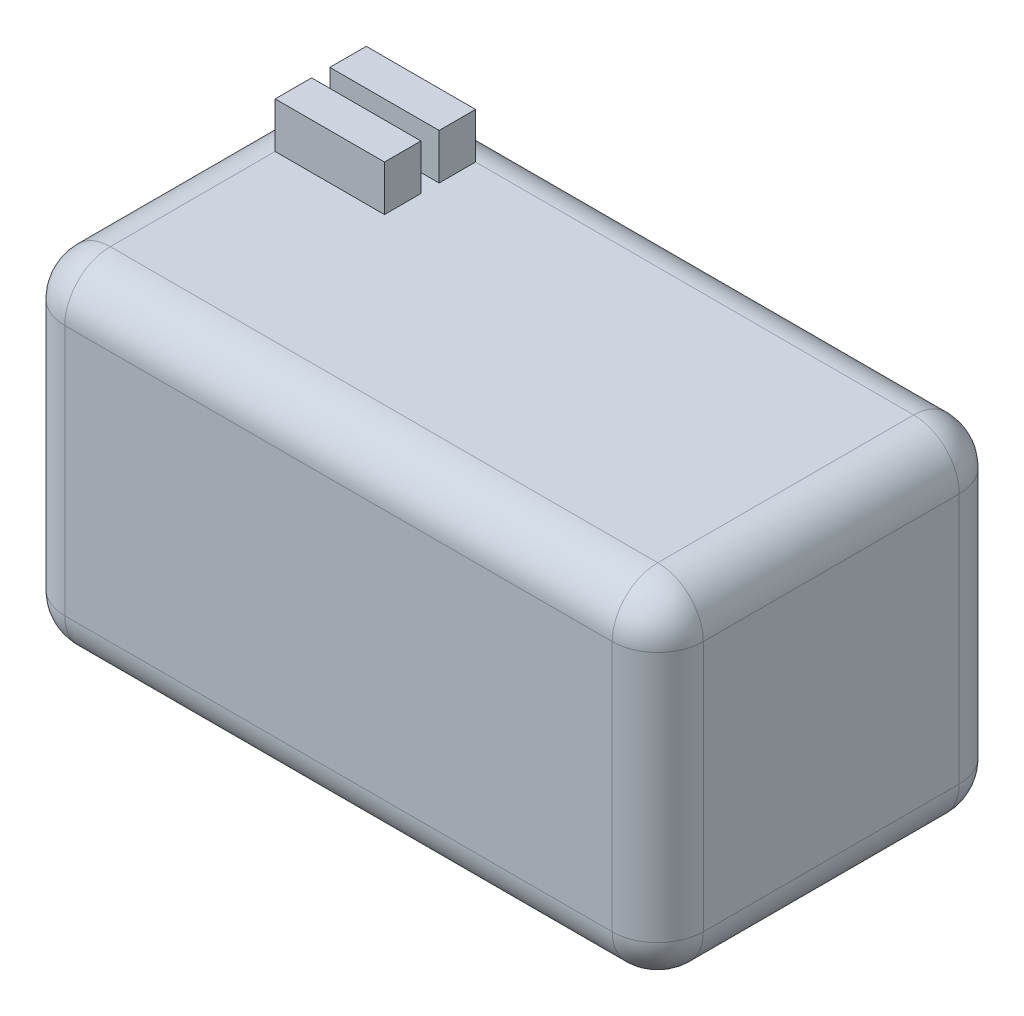
ISO-10303-21;
HEADER;
FILE_DESCRIPTION(('STEP AP214'),'2;1');
FILE_NAME('part.step','',(''),(''),'','','');
FILE_SCHEMA(('AUTOMOTIVE_DESIGN { 1 0 10303 214 1 1 1 1 }'));
ENDSEC;
DATA;
#1=APPLICATION_CONTEXT('core data for automotive mechanical design processes');
#2=APPLICATION_PROTOCOL_DEFINITION('international standard','automotive_design',2000,#1);
#3=PRODUCT_CONTEXT('',#1,'mechanical');
#4=PRODUCT('Part','Part','',(#3));
#5=PRODUCT_RELATED_PRODUCT_CATEGORY('part','',(#4));
#6=PRODUCT_DEFINITION_FORMATION('','',#4);
#7=PRODUCT_DEFINITION_CONTEXT('part definition',#1,'design');
#8=PRODUCT_DEFINITION('design','',#6,#7);
#9=PRODUCT_DEFINITION_SHAPE('','',#8);
#10=(LENGTH_UNIT() NAMED_UNIT(*) SI_UNIT(.MILLI.,.METRE.));
#11=(NAMED_UNIT(*) PLANE_ANGLE_UNIT() SI_UNIT($,.RADIAN.));
#12=(NAMED_UNIT(*) SI_UNIT($,.STERADIAN.) SOLID_ANGLE_UNIT());
#13=UNCERTAINTY_MEASURE_WITH_UNIT(LENGTH_MEASURE(1.E-05),#10,'distance_accuracy_value','');
#14=(GEOMETRIC_REPRESENTATION_CONTEXT(3) GLOBAL_UNCERTAINTY_ASSIGNED_CONTEXT((#13)) GLOBAL_UNIT_ASSIGNED_CONTEXT((#10,
#11,#12)) REPRESENTATION_CONTEXT('',''));
#15=CARTESIAN_POINT('',(0.,0.,0.));
#16=DIRECTION('',(0.,0.,1.));
#17=DIRECTION('',(1.,0.,0.));
#18=AXIS2_PLACEMENT_3D('',#15,#16,#17);
#19=CARTESIAN_POINT('',(41.1271903323263,26.0643202416919,38.1));
#20=DIRECTION('',(0.,-1.,0.));
#21=DIRECTION('',(1.,0.,0.));
#22=AXIS2_PLACEMENT_3D('',#19,#20,#21);
#23=PLANE('',#22);
#24=DIRECTION('',(0.,0.,-1.));
#25=VECTOR('',#24,1.);
#26=CARTESIAN_POINT('',(-11.9728096676737,26.0643202416919,0.));
#27=LINE('',#26,#25);
#28=CARTESIAN_POINT('',(-11.9728096676737,26.0643202416919,8.99999999999999));
#29=VERTEX_POINT('',#28);
#30=CARTESIAN_POINT('',(-11.9728096676737,26.0643202416919,5.));
#31=VERTEX_POINT('',#30);
#32=EDGE_CURVE('E58',#29,#31,#27,.T.);
#33=ORIENTED_EDGE('',*,*,#32,.F.);
#34=DIRECTION('',(-1.,0.,0.));
#35=VECTOR('',#34,1.);
#36=CARTESIAN_POINT('',(0.,26.0643202416919,9.));
#37=LINE('',#36,#35);
#38=CARTESIAN_POINT('',(-23.9728096676737,26.0643202416919,9.));
#39=VERTEX_POINT('',#38);
#40=EDGE_CURVE('E63',#29,#39,#37,.T.);
#41=ORIENTED_EDGE('',*,*,#40,.T.);
#42=DIRECTION('',(0.,0.,-1.));
#43=VECTOR('',#42,1.);
#44=CARTESIAN_POINT('',(-23.9728096676737,26.0643202416919,38.1));
#45=LINE('',#44,#43);
#46=CARTESIAN_POINT('',(-23.9728096676737,26.0643202416919,11.));
#47=VERTEX_POINT('',#46);
#48=EDGE_CURVE('E293',#39,#47,#45,.F.);
#49=ORIENTED_EDGE('',*,*,#48,.T.);
#50=DIRECTION('',(1.,0.,0.));
#51=VECTOR('',#50,1.);
#52=CARTESIAN_POINT('',(0.,26.0643202416919,11.));
#53=LINE('',#52,#51);
#54=CARTESIAN_POINT('',(-11.9728096676737,26.0643202416919,11.));
#55=VERTEX_POINT('',#54);
#56=EDGE_CURVE('E183',#47,#55,#53,.T.);
#57=ORIENTED_EDGE('',*,*,#56,.T.);
#58=DIRECTION('',(0.,0.,-1.));
#59=VECTOR('',#58,1.);
#60=CARTESIAN_POINT('',(-11.9728096676737,26.0643202416919,0.));
#61=LINE('',#60,#59);
#62=CARTESIAN_POINT('',(-11.9728096676737,26.0643202416919,15.));
#63=VERTEX_POINT('',#62);
#64=EDGE_CURVE('E217',#63,#55,#61,.T.);
#65=ORIENTED_EDGE('',*,*,#64,.F.);
#66=DIRECTION('',(1.,0.,0.));
#67=VECTOR('',#66,1.);
#68=CARTESIAN_POINT('',(0.,26.0643202416919,15.));
#69=LINE('',#68,#67);
#70=CARTESIAN_POINT('',(-23.9728096676737,26.0643202416919,15.));
#71=VERTEX_POINT('',#70);
#72=EDGE_CURVE('E228',#71,#63,#69,.T.);
#73=ORIENTED_EDGE('',*,*,#72,.F.);
#74=CARTESIAN_POINT('',(-23.9728096676737,26.0643202416919,33.1));
#75=VERTEX_POINT('',#74);
#76=EDGE_CURVE('E288',#71,#75,#45,.F.);
#77=ORIENTED_EDGE('',*,*,#76,.T.);
#78=DIRECTION('',(-1.,0.,0.));
#79=VECTOR('',#78,1.);
#80=CARTESIAN_POINT('',(41.1271903323263,26.0643202416919,33.1));
#81=LINE('',#80,#79);
#82=CARTESIAN_POINT('',(36.1271903323263,26.0643202416919,33.1));
#83=VERTEX_POINT('',#82);
#84=EDGE_CURVE('E285',#75,#83,#81,.F.);
#85=ORIENTED_EDGE('',*,*,#84,.T.);
#86=DIRECTION('',(0.,0.,-1.));
#87=VECTOR('',#86,1.);
#88=CARTESIAN_POINT('',(36.1271903323263,26.0643202416919,38.1));
#89=LINE('',#88,#87);
#90=CARTESIAN_POINT('',(36.1271903323263,26.0643202416919,5.));
#91=VERTEX_POINT('',#90);
#92=EDGE_CURVE('E281',#83,#91,#89,.T.);
#93=ORIENTED_EDGE('',*,*,#92,.T.);
#94=DIRECTION('',(-1.,0.,0.));
#95=VECTOR('',#94,1.);
#96=CARTESIAN_POINT('',(41.1271903323263,26.0643202416919,5.));
#97=LINE('',#96,#95);
#98=EDGE_CURVE('E283',#91,#31,#97,.T.);
#99=ORIENTED_EDGE('',*,*,#98,.T.);
#100=EDGE_LOOP('',(#33,#41,#49,#57,#65,#73,#77,#85,#93,#99));
#101=FACE_BOUND('',#100,.T.);
#102=ADVANCED_FACE('F41',(#101),#23,.F.);
#103=CARTESIAN_POINT('',(-28.9728096676737,26.0643202416919,38.1));
#104=DIRECTION('',(1.,0.,0.));
#105=DIRECTION('',(0.,0.,-1.));
#106=AXIS2_PLACEMENT_3D('',#103,#104,#105);
#107=PLANE('',#106);
#108=DIRECTION('',(0.,-1.,0.));
#109=VECTOR('',#108,1.);
#110=CARTESIAN_POINT('',(-28.9728096676737,26.0643202416919,5.));
#111=LINE('',#110,#109);
#112=CARTESIAN_POINT('',(-28.9728096676737,21.0643202416919,5.));
#113=VERTEX_POINT('',#112);
#114=CARTESIAN_POINT('',(-28.9728096676737,-6.52567975830815,5.));
#115=VERTEX_POINT('',#114);
#116=EDGE_CURVE('E274',#113,#115,#111,.T.);
#117=ORIENTED_EDGE('',*,*,#116,.T.);
#118=DIRECTION('',(0.,0.,-1.));
#119=VECTOR('',#118,1.);
#120=CARTESIAN_POINT('',(-28.9728096676737,-6.52567975830815,38.1));
#121=LINE('',#120,#119);
#122=CARTESIAN_POINT('',(-28.9728096676737,-6.52567975830815,33.1));
#123=VERTEX_POINT('',#122);
#124=EDGE_CURVE('E279',#115,#123,#121,.F.);
#125=ORIENTED_EDGE('',*,*,#124,.T.);
#126=DIRECTION('',(0.,-1.,0.));
#127=VECTOR('',#126,1.);
#128=CARTESIAN_POINT('',(-28.9728096676737,26.0643202416919,33.1));
#129=LINE('',#128,#127);
#130=CARTESIAN_POINT('',(-28.9728096676737,21.0643202416919,33.1));
#131=VERTEX_POINT('',#130);
#132=EDGE_CURVE('E276',#123,#131,#129,.F.);
#133=ORIENTED_EDGE('',*,*,#132,.T.);
#134=DIRECTION('',(0.,0.,-1.));
#135=VECTOR('',#134,1.);
#136=CARTESIAN_POINT('',(-28.9728096676737,21.0643202416919,38.1));
#137=LINE('',#136,#135);
#138=EDGE_CURVE('E272',#131,#113,#137,.T.);
#139=ORIENTED_EDGE('',*,*,#138,.T.);
#140=EDGE_LOOP('',(#117,#125,#133,#139));
#141=FACE_BOUND('',#140,.T.);
#142=ADVANCED_FACE('F390',(#141),#107,.F.);
#143=CARTESIAN_POINT('',(-28.9728096676737,-11.5256797583082,38.1));
#144=DIRECTION('',(0.,1.,0.));
#145=DIRECTION('',(0.,0.,1.));
#146=AXIS2_PLACEMENT_3D('',#143,#144,#145);
#147=PLANE('',#146);
#148=DIRECTION('',(1.,0.,0.));
#149=VECTOR('',#148,1.);
#150=CARTESIAN_POINT('',(-28.9728096676737,-11.5256797583082,33.1));
#151=LINE('',#150,#149);
#152=CARTESIAN_POINT('',(36.1271903323263,-11.5256797583082,33.1));
#153=VERTEX_POINT('',#152);
#154=CARTESIAN_POINT('',(-23.9728096676737,-11.5256797583082,33.1));
#155=VERTEX_POINT('',#154);
#156=EDGE_CURVE('E267',#153,#155,#151,.F.);
#157=ORIENTED_EDGE('',*,*,#156,.T.);
#158=DIRECTION('',(0.,0.,-1.));
#159=VECTOR('',#158,1.);
#160=CARTESIAN_POINT('',(-23.9728096676737,-11.5256797583082,38.1));
#161=LINE('',#160,#159);
#162=CARTESIAN_POINT('',(-23.9728096676737,-11.5256797583082,5.));
#163=VERTEX_POINT('',#162);
#164=EDGE_CURVE('E270',#155,#163,#161,.T.);
#165=ORIENTED_EDGE('',*,*,#164,.T.);
#166=DIRECTION('',(1.,0.,0.));
#167=VECTOR('',#166,1.);
#168=CARTESIAN_POINT('',(-28.9728096676737,-11.5256797583082,5.));
#169=LINE('',#168,#167);
#170=CARTESIAN_POINT('',(36.1271903323263,-11.5256797583082,5.));
#171=VERTEX_POINT('',#170);
#172=EDGE_CURVE('E265',#163,#171,#169,.T.);
#173=ORIENTED_EDGE('',*,*,#172,.T.);
#174=DIRECTION('',(0.,0.,-1.));
#175=VECTOR('',#174,1.);
#176=CARTESIAN_POINT('',(36.1271903323263,-11.5256797583082,38.1));
#177=LINE('',#176,#175);
#178=EDGE_CURVE('E263',#171,#153,#177,.F.);
#179=ORIENTED_EDGE('',*,*,#178,.T.);
#180=EDGE_LOOP('',(#157,#165,#173,#179));
#181=FACE_BOUND('',#180,.T.);
#182=ADVANCED_FACE('F381',(#181),#147,.F.);
#183=CARTESIAN_POINT('',(41.1271903323263,-11.5256797583082,38.1));
#184=DIRECTION('',(-1.,0.,0.));
#185=DIRECTION('',(0.,0.,1.));
#186=AXIS2_PLACEMENT_3D('',#183,#184,#185);
#187=PLANE('',#186);
#188=DIRECTION('',(0.,1.,0.));
#189=VECTOR('',#188,1.);
#190=CARTESIAN_POINT('',(41.1271903323263,-11.5256797583082,5.));
#191=LINE('',#190,#189);
#192=CARTESIAN_POINT('',(41.1271903323263,-6.52567975830815,5.));
#193=VERTEX_POINT('',#192);
#194=CARTESIAN_POINT('',(41.1271903323263,21.0643202416919,5.));
#195=VERTEX_POINT('',#194);
#196=EDGE_CURVE('E256',#193,#195,#191,.T.);
#197=ORIENTED_EDGE('',*,*,#196,.T.);
#198=DIRECTION('',(0.,0.,-1.));
#199=VECTOR('',#198,1.);
#200=CARTESIAN_POINT('',(41.1271903323263,21.0643202416919,38.1));
#201=LINE('',#200,#199);
#202=CARTESIAN_POINT('',(41.1271903323263,21.0643202416919,33.1));
#203=VERTEX_POINT('',#202);
#204=EDGE_CURVE('E261',#195,#203,#201,.F.);
#205=ORIENTED_EDGE('',*,*,#204,.T.);
#206=DIRECTION('',(0.,1.,0.));
#207=VECTOR('',#206,1.);
#208=CARTESIAN_POINT('',(41.1271903323263,-11.5256797583082,33.1));
#209=LINE('',#208,#207);
#210=CARTESIAN_POINT('',(41.1271903323263,-6.52567975830815,33.1));
#211=VERTEX_POINT('',#210);
#212=EDGE_CURVE('E258',#203,#211,#209,.F.);
#213=ORIENTED_EDGE('',*,*,#212,.T.);
#214=DIRECTION('',(0.,0.,-1.));
#215=VECTOR('',#214,1.);
#216=CARTESIAN_POINT('',(41.1271903323263,-6.52567975830815,38.1));
#217=LINE('',#216,#215);
#218=EDGE_CURVE('E254',#211,#193,#217,.T.);
#219=ORIENTED_EDGE('',*,*,#218,.T.);
#220=EDGE_LOOP('',(#197,#205,#213,#219));
#221=FACE_BOUND('',#220,.T.);
#222=ADVANCED_FACE('F424',(#221),#187,.F.);
#223=CARTESIAN_POINT('',(0.,0.,38.1));
#224=DIRECTION('',(0.,0.,1.));
#225=DIRECTION('',(1.,0.,0.));
#226=AXIS2_PLACEMENT_3D('',#223,#224,#225);
#227=PLANE('',#226);
#228=DIRECTION('',(1.,0.,0.));
#229=VECTOR('',#228,1.);
#230=CARTESIAN_POINT('',(41.1271903323263,-6.52567975830815,38.1));
#231=LINE('',#230,#229);
#232=CARTESIAN_POINT('',(-23.9728096676737,-6.52567975830815,38.1));
#233=VERTEX_POINT('',#232);
#234=CARTESIAN_POINT('',(36.1271903323263,-6.52567975830815,38.1));
#235=VERTEX_POINT('',#234);
#236=EDGE_CURVE('E249',#233,#235,#231,.T.);
#237=ORIENTED_EDGE('',*,*,#236,.T.);
#238=DIRECTION('',(0.,1.,0.));
#239=VECTOR('',#238,1.);
#240=CARTESIAN_POINT('',(36.1271903323263,26.0643202416919,38.1));
#241=LINE('',#240,#239);
#242=CARTESIAN_POINT('',(36.1271903323263,21.0643202416919,38.1));
#243=VERTEX_POINT('',#242);
#244=EDGE_CURVE('E251',#235,#243,#241,.T.);
#245=ORIENTED_EDGE('',*,*,#244,.T.);
#246=DIRECTION('',(-1.,0.,0.));
#247=VECTOR('',#246,1.);
#248=CARTESIAN_POINT('',(-28.9728096676737,21.0643202416919,38.1));
#249=LINE('',#248,#247);
#250=CARTESIAN_POINT('',(-23.9728096676737,21.0643202416919,38.1));
#251=VERTEX_POINT('',#250);
#252=EDGE_CURVE('E245',#243,#251,#249,.T.);
#253=ORIENTED_EDGE('',*,*,#252,.T.);
#254=DIRECTION('',(0.,-1.,0.));
#255=VECTOR('',#254,1.);
#256=CARTESIAN_POINT('',(-23.9728096676737,-11.5256797583082,38.1));
#257=LINE('',#256,#255);
#258=EDGE_CURVE('E247',#251,#233,#257,.T.);
#259=ORIENTED_EDGE('',*,*,#258,.T.);
#260=EDGE_LOOP('',(#237,#245,#253,#259));
#261=FACE_BOUND('',#260,.T.);
#262=ADVANCED_FACE('F778',(#261),#227,.T.);
#263=CARTESIAN_POINT('',(0.,0.,0.));
#264=DIRECTION('',(0.,0.,1.));
#265=DIRECTION('',(1.,0.,0.));
#266=AXIS2_PLACEMENT_3D('',#263,#264,#265);
#267=PLANE('',#266);
#268=DIRECTION('',(1.,0.,0.));
#269=VECTOR('',#268,1.);
#270=CARTESIAN_POINT('',(0.,-6.52567975830815,0.));
#271=LINE('',#270,#269);
#272=CARTESIAN_POINT('',(36.1271903323263,-6.52567975830815,0.));
#273=VERTEX_POINT('',#272);
#274=CARTESIAN_POINT('',(-23.9728096676737,-6.52567975830815,0.));
#275=VERTEX_POINT('',#274);
#276=EDGE_CURVE('E50',#273,#275,#271,.F.);
#277=ORIENTED_EDGE('',*,*,#276,.T.);
#278=DIRECTION('',(0.,-1.,0.));
#279=VECTOR('',#278,1.);
#280=CARTESIAN_POINT('',(-23.9728096676737,0.,0.));
#281=LINE('',#280,#279);
#282=CARTESIAN_POINT('',(-23.9728096676737,21.0643202416919,0.));
#283=VERTEX_POINT('',#282);
#284=EDGE_CURVE('E11',#275,#283,#281,.F.);
#285=ORIENTED_EDGE('',*,*,#284,.T.);
#286=DIRECTION('',(-1.,0.,0.));
#287=VECTOR('',#286,1.);
#288=CARTESIAN_POINT('',(0.,21.0643202416919,0.));
#289=LINE('',#288,#287);
#290=CARTESIAN_POINT('',(36.1271903323263,21.0643202416919,0.));
#291=VERTEX_POINT('',#290);
#292=EDGE_CURVE('E295',#283,#291,#289,.F.);
#293=ORIENTED_EDGE('',*,*,#292,.T.);
#294=DIRECTION('',(0.,1.,0.));
#295=VECTOR('',#294,1.);
#296=CARTESIAN_POINT('',(36.1271903323263,0.,0.));
#297=LINE('',#296,#295);
#298=EDGE_CURVE('E292',#291,#273,#297,.F.);
#299=ORIENTED_EDGE('',*,*,#298,.T.);
#300=EDGE_LOOP('',(#277,#285,#293,#299));
#301=FACE_BOUND('',#300,.T.);
#302=ADVANCED_FACE('F404',(#301),#267,.F.);
#303=CARTESIAN_POINT('',(-23.9728096676737,26.0643202416919,5.));
#304=DIRECTION('',(0.,-1.,0.));
#305=DIRECTION('',(0.,0.,-1.));
#306=AXIS2_PLACEMENT_3D('',#303,#304,#305);
#307=CYLINDRICAL_SURFACE('',#306,5.);
#308=CARTESIAN_POINT('',(-23.9728096676737,-6.52567975830815,5.));
#309=DIRECTION('',(0.,-1.,0.));
#310=DIRECTION('',(0.,0.,-1.));
#311=AXIS2_PLACEMENT_3D('',#308,#309,#310);
#312=CIRCLE('',#311,5.);
#313=EDGE_CURVE('E45',#115,#275,#312,.T.);
#314=ORIENTED_EDGE('',*,*,#313,.F.);
#315=ORIENTED_EDGE('',*,*,#116,.F.);
#316=CARTESIAN_POINT('',(-23.9728096676737,21.0643202416919,5.));
#317=DIRECTION('',(0.,1.,0.));
#318=DIRECTION('',(-1.,0.,0.));
#319=AXIS2_PLACEMENT_3D('',#316,#317,#318);
#320=CIRCLE('',#319,5.);
#321=EDGE_CURVE('E357',#283,#113,#320,.T.);
#322=ORIENTED_EDGE('',*,*,#321,.F.);
#323=ORIENTED_EDGE('',*,*,#284,.F.);
#324=EDGE_LOOP('',(#314,#315,#322,#323));
#325=FACE_BOUND('',#324,.T.);
#326=ADVANCED_FACE('F43',(#325),#307,.T.);
#327=CARTESIAN_POINT('',(-23.9728096676737,-6.52567975830815,5.));
#328=DIRECTION('',(0.,0.,1.));
#329=DIRECTION('',(1.,0.,0.));
#330=AXIS2_PLACEMENT_3D('',#327,#328,#329);
#331=SPHERICAL_SURFACE('',#330,5.);
#332=CARTESIAN_POINT('',(-23.9728096676737,-6.52567975830815,5.));
#333=DIRECTION('',(0.,0.,-1.));
#334=DIRECTION('',(-1.,0.,0.));
#335=AXIS2_PLACEMENT_3D('',#332,#333,#334);
#336=CIRCLE('',#335,5.);
#337=EDGE_CURVE('E352',#115,#163,#336,.F.);
#338=ORIENTED_EDGE('',*,*,#337,.F.);
#339=ORIENTED_EDGE('',*,*,#313,.T.);
#340=CARTESIAN_POINT('',(-23.9728096676737,-6.52567975830815,5.));
#341=DIRECTION('',(-1.,0.,0.));
#342=DIRECTION('',(0.,0.,1.));
#343=AXIS2_PLACEMENT_3D('',#340,#341,#342);
#344=CIRCLE('',#343,5.);
#345=EDGE_CURVE('E355',#163,#275,#344,.F.);
#346=ORIENTED_EDGE('',*,*,#345,.F.);
#347=EDGE_LOOP('',(#338,#339,#346));
#348=FACE_BOUND('',#347,.T.);
#349=ADVANCED_FACE('F368',(#348),#331,.T.);
#350=CARTESIAN_POINT('',(-23.9728096676737,21.0643202416919,5.));
#351=DIRECTION('',(0.,0.,1.));
#352=DIRECTION('',(1.,0.,0.));
#353=AXIS2_PLACEMENT_3D('',#350,#351,#352);
#354=SPHERICAL_SURFACE('',#353,5.);
#355=CARTESIAN_POINT('',(-23.9728096676737,21.0643202416919,5.));
#356=DIRECTION('',(-1.,0.,0.));
#357=DIRECTION('',(0.,0.,1.));
#358=AXIS2_PLACEMENT_3D('',#355,#356,#357);
#359=CIRCLE('',#358,5.);
#360=CARTESIAN_POINT('',(-23.9728096676737,26.0643202416919,5.));
#361=VERTEX_POINT('',#360);
#362=EDGE_CURVE('E346',#283,#361,#359,.F.);
#363=ORIENTED_EDGE('',*,*,#362,.F.);
#364=ORIENTED_EDGE('',*,*,#321,.T.);
#365=CARTESIAN_POINT('',(-23.9728096676737,21.0643202416919,5.));
#366=DIRECTION('',(0.,0.,-1.));
#367=DIRECTION('',(-1.,0.,0.));
#368=AXIS2_PLACEMENT_3D('',#365,#366,#367);
#369=CIRCLE('',#368,5.);
#370=EDGE_CURVE('E349',#361,#113,#369,.F.);
#371=ORIENTED_EDGE('',*,*,#370,.F.);
#372=EDGE_LOOP('',(#363,#364,#371));
#373=FACE_BOUND('',#372,.T.);
#374=ADVANCED_FACE('F747',(#373),#354,.T.);
#375=CARTESIAN_POINT('',(-28.9728096676737,-6.52567975830815,5.));
#376=DIRECTION('',(1.,0.,0.));
#377=DIRECTION('',(0.,0.,-1.));
#378=AXIS2_PLACEMENT_3D('',#375,#376,#377);
#379=CYLINDRICAL_SURFACE('',#378,5.);
#380=ORIENTED_EDGE('',*,*,#345,.T.);
#381=ORIENTED_EDGE('',*,*,#276,.F.);
#382=CARTESIAN_POINT('',(36.1271903323263,-6.52567975830815,5.));
#383=DIRECTION('',(1.,0.,0.));
#384=DIRECTION('',(0.,0.,-1.));
#385=AXIS2_PLACEMENT_3D('',#382,#383,#384);
#386=CIRCLE('',#385,5.);
#387=EDGE_CURVE('E340',#171,#273,#386,.T.);
#388=ORIENTED_EDGE('',*,*,#387,.F.);
#389=ORIENTED_EDGE('',*,*,#172,.F.);
#390=EDGE_LOOP('',(#380,#381,#388,#389));
#391=FACE_BOUND('',#390,.T.);
#392=ADVANCED_FACE('F376',(#391),#379,.T.);
#393=CARTESIAN_POINT('',(-23.9728096676737,-6.52567975830815,38.1));
#394=DIRECTION('',(0.,0.,-1.));
#395=DIRECTION('',(-1.,0.,0.));
#396=AXIS2_PLACEMENT_3D('',#393,#394,#395);
#397=CYLINDRICAL_SURFACE('',#396,5.);
#398=ORIENTED_EDGE('',*,*,#337,.T.);
#399=ORIENTED_EDGE('',*,*,#164,.F.);
#400=CARTESIAN_POINT('',(-23.9728096676737,-6.52567975830815,33.1));
#401=DIRECTION('',(0.,0.,1.));
#402=DIRECTION('',(1.,0.,0.));
#403=AXIS2_PLACEMENT_3D('',#400,#401,#402);
#404=CIRCLE('',#403,5.);
#405=EDGE_CURVE('E337',#123,#155,#404,.T.);
#406=ORIENTED_EDGE('',*,*,#405,.F.);
#407=ORIENTED_EDGE('',*,*,#124,.F.);
#408=EDGE_LOOP('',(#398,#399,#406,#407));
#409=FACE_BOUND('',#408,.T.);
#410=ADVANCED_FACE('F387',(#409),#397,.T.);
#411=CARTESIAN_POINT('',(-23.9728096676737,0.,33.1));
#412=DIRECTION('',(0.,1.,0.));
#413=DIRECTION('',(0.,0.,1.));
#414=AXIS2_PLACEMENT_3D('',#411,#412,#413);
#415=CYLINDRICAL_SURFACE('',#414,5.);
#416=CARTESIAN_POINT('',(-23.9728096676737,21.0643202416919,33.1));
#417=DIRECTION('',(0.,1.,0.));
#418=DIRECTION('',(0.,0.,1.));
#419=AXIS2_PLACEMENT_3D('',#416,#417,#418);
#420=CIRCLE('',#419,5.);
#421=EDGE_CURVE('E331',#131,#251,#420,.T.);
#422=ORIENTED_EDGE('',*,*,#421,.F.);
#423=ORIENTED_EDGE('',*,*,#132,.F.);
#424=CARTESIAN_POINT('',(-23.9728096676737,-6.52567975830815,33.1));
#425=DIRECTION('',(0.,-1.,0.));
#426=DIRECTION('',(0.,0.,-1.));
#427=AXIS2_PLACEMENT_3D('',#424,#425,#426);
#428=CIRCLE('',#427,5.);
#429=EDGE_CURVE('E334',#233,#123,#428,.T.);
#430=ORIENTED_EDGE('',*,*,#429,.F.);
#431=ORIENTED_EDGE('',*,*,#258,.F.);
#432=EDGE_LOOP('',(#422,#423,#430,#431));
#433=FACE_BOUND('',#432,.T.);
#434=ADVANCED_FACE('F394',(#433),#415,.T.);
#435=CARTESIAN_POINT('',(-23.9728096676737,21.0643202416919,38.1));
#436=DIRECTION('',(0.,0.,-1.));
#437=DIRECTION('',(-1.,0.,0.));
#438=AXIS2_PLACEMENT_3D('',#435,#436,#437);
#439=CYLINDRICAL_SURFACE('',#438,5.);
#440=ORIENTED_EDGE('',*,*,#370,.T.);
#441=ORIENTED_EDGE('',*,*,#138,.F.);
#442=CARTESIAN_POINT('',(-23.9728096676737,21.0643202416919,33.1));
#443=DIRECTION('',(0.,0.,1.));
#444=DIRECTION('',(1.,0.,0.));
#445=AXIS2_PLACEMENT_3D('',#442,#443,#444);
#446=CIRCLE('',#445,5.);
#447=EDGE_CURVE('E329',#75,#131,#446,.T.);
#448=ORIENTED_EDGE('',*,*,#447,.F.);
#449=ORIENTED_EDGE('',*,*,#76,.F.);
#450=DIRECTION('',(0.,0.,1.));
#451=VECTOR('',#450,1.);
#452=CARTESIAN_POINT('',(-23.9728096676737,26.0643202416919,0.));
#453=LINE('',#452,#451);
#454=EDGE_CURVE('E225',#47,#71,#453,.T.);
#455=ORIENTED_EDGE('',*,*,#454,.F.);
#456=ORIENTED_EDGE('',*,*,#48,.F.);
#457=EDGE_CURVE('E289',#361,#39,#45,.F.);
#458=ORIENTED_EDGE('',*,*,#457,.F.);
#459=EDGE_LOOP('',(#440,#441,#448,#449,#455,#456,#458));
#460=FACE_BOUND('',#459,.T.);
#461=ADVANCED_FACE('F402',(#460),#439,.T.);
#462=CARTESIAN_POINT('',(41.1271903323263,21.0643202416919,5.));
#463=DIRECTION('',(-1.,0.,0.));
#464=DIRECTION('',(0.,-1.,0.));
#465=AXIS2_PLACEMENT_3D('',#462,#463,#464);
#466=CYLINDRICAL_SURFACE('',#465,5.);
#467=ORIENTED_EDGE('',*,*,#362,.T.);
#468=DIRECTION('',(-1.,0.,0.));
#469=VECTOR('',#468,1.);
#470=CARTESIAN_POINT('',(0.,26.0643202416919,5.));
#471=LINE('',#470,#469);
#472=EDGE_CURVE('E198',#31,#361,#471,.T.);
#473=ORIENTED_EDGE('',*,*,#472,.F.);
#474=ORIENTED_EDGE('',*,*,#98,.F.);
#475=CARTESIAN_POINT('',(36.1271903323263,21.0643202416919,5.));
#476=DIRECTION('',(1.,0.,0.));
#477=DIRECTION('',(0.,0.,-1.));
#478=AXIS2_PLACEMENT_3D('',#475,#476,#477);
#479=CIRCLE('',#478,5.);
#480=EDGE_CURVE('E326',#291,#91,#479,.T.);
#481=ORIENTED_EDGE('',*,*,#480,.F.);
#482=ORIENTED_EDGE('',*,*,#292,.F.);
#483=EDGE_LOOP('',(#467,#473,#474,#481,#482));
#484=FACE_BOUND('',#483,.T.);
#485=ADVANCED_FACE('F414',(#484),#466,.T.);
#486=CARTESIAN_POINT('',(36.1271903323263,-11.5256797583082,5.));
#487=DIRECTION('',(0.,1.,0.));
#488=DIRECTION('',(0.,0.,1.));
#489=AXIS2_PLACEMENT_3D('',#486,#487,#488);
#490=CYLINDRICAL_SURFACE('',#489,5.);
#491=CARTESIAN_POINT('',(36.1271903323263,-6.52567975830815,5.));
#492=DIRECTION('',(0.,-1.,0.));
#493=DIRECTION('',(1.,0.,0.));
#494=AXIS2_PLACEMENT_3D('',#491,#492,#493);
#495=CIRCLE('',#494,5.);
#496=EDGE_CURVE('E343',#273,#193,#495,.T.);
#497=ORIENTED_EDGE('',*,*,#496,.F.);
#498=ORIENTED_EDGE('',*,*,#298,.F.);
#499=CARTESIAN_POINT('',(36.1271903323263,21.0643202416919,5.));
#500=DIRECTION('',(0.,1.,0.));
#501=DIRECTION('',(0.,0.,1.));
#502=AXIS2_PLACEMENT_3D('',#499,#500,#501);
#503=CIRCLE('',#502,5.);
#504=EDGE_CURVE('E323',#195,#291,#503,.T.);
#505=ORIENTED_EDGE('',*,*,#504,.F.);
#506=ORIENTED_EDGE('',*,*,#196,.F.);
#507=EDGE_LOOP('',(#497,#498,#505,#506));
#508=FACE_BOUND('',#507,.T.);
#509=ADVANCED_FACE('F409',(#508),#490,.T.);
#510=CARTESIAN_POINT('',(36.1271903323263,-6.52567975830815,5.));
#511=DIRECTION('',(0.,0.,1.));
#512=DIRECTION('',(1.,0.,0.));
#513=AXIS2_PLACEMENT_3D('',#510,#511,#512);
#514=SPHERICAL_SURFACE('',#513,5.);
#515=ORIENTED_EDGE('',*,*,#387,.T.);
#516=ORIENTED_EDGE('',*,*,#496,.T.);
#517=CARTESIAN_POINT('',(36.1271903323263,-6.52567975830815,5.));
#518=DIRECTION('',(0.,0.,-1.));
#519=DIRECTION('',(-1.,0.,0.));
#520=AXIS2_PLACEMENT_3D('',#517,#518,#519);
#521=CIRCLE('',#520,5.);
#522=EDGE_CURVE('E320',#171,#193,#521,.F.);
#523=ORIENTED_EDGE('',*,*,#522,.F.);
#524=EDGE_LOOP('',(#515,#516,#523));
#525=FACE_BOUND('',#524,.T.);
#526=ADVANCED_FACE('F427',(#525),#514,.T.);
#527=CARTESIAN_POINT('',(-23.9728096676737,-6.52567975830815,33.1));
#528=DIRECTION('',(0.,0.,1.));
#529=DIRECTION('',(1.,0.,0.));
#530=AXIS2_PLACEMENT_3D('',#527,#528,#529);
#531=SPHERICAL_SURFACE('',#530,5.);
#532=ORIENTED_EDGE('',*,*,#429,.T.);
#533=ORIENTED_EDGE('',*,*,#405,.T.);
#534=CARTESIAN_POINT('',(-23.9728096676737,-6.52567975830815,33.1));
#535=DIRECTION('',(-1.,0.,0.));
#536=DIRECTION('',(0.,0.,1.));
#537=AXIS2_PLACEMENT_3D('',#534,#535,#536);
#538=CIRCLE('',#537,5.);
#539=EDGE_CURVE('E318',#233,#155,#538,.F.);
#540=ORIENTED_EDGE('',*,*,#539,.F.);
#541=EDGE_LOOP('',(#532,#533,#540));
#542=FACE_BOUND('',#541,.T.);
#543=ADVANCED_FACE('F440',(#542),#531,.T.);
#544=CARTESIAN_POINT('',(-23.9728096676737,21.0643202416919,33.1));
#545=DIRECTION('',(0.,0.,1.));
#546=DIRECTION('',(1.,0.,0.));
#547=AXIS2_PLACEMENT_3D('',#544,#545,#546);
#548=SPHERICAL_SURFACE('',#547,5.);
#549=ORIENTED_EDGE('',*,*,#447,.T.);
#550=ORIENTED_EDGE('',*,*,#421,.T.);
#551=CARTESIAN_POINT('',(-23.9728096676737,21.0643202416919,33.1));
#552=DIRECTION('',(-1.,0.,0.));
#553=DIRECTION('',(0.,0.,1.));
#554=AXIS2_PLACEMENT_3D('',#551,#552,#553);
#555=CIRCLE('',#554,5.);
#556=EDGE_CURVE('E315',#75,#251,#555,.F.);
#557=ORIENTED_EDGE('',*,*,#556,.F.);
#558=EDGE_LOOP('',(#549,#550,#557));
#559=FACE_BOUND('',#558,.T.);
#560=ADVANCED_FACE('F442',(#559),#548,.T.);
#561=CARTESIAN_POINT('',(36.1271903323263,21.0643202416919,5.));
#562=DIRECTION('',(0.,0.,1.));
#563=DIRECTION('',(1.,0.,0.));
#564=AXIS2_PLACEMENT_3D('',#561,#562,#563);
#565=SPHERICAL_SURFACE('',#564,5.);
#566=ORIENTED_EDGE('',*,*,#504,.T.);
#567=ORIENTED_EDGE('',*,*,#480,.T.);
#568=CARTESIAN_POINT('',(36.1271903323263,21.0643202416919,5.));
#569=DIRECTION('',(0.,0.,-1.));
#570=DIRECTION('',(-1.,0.,0.));
#571=AXIS2_PLACEMENT_3D('',#568,#569,#570);
#572=CIRCLE('',#571,5.);
#573=EDGE_CURVE('E312',#195,#91,#572,.F.);
#574=ORIENTED_EDGE('',*,*,#573,.F.);
#575=EDGE_LOOP('',(#566,#567,#574));
#576=FACE_BOUND('',#575,.T.);
#577=ADVANCED_FACE('F416',(#576),#565,.T.);
#578=CARTESIAN_POINT('',(36.1271903323263,-6.52567975830815,38.1));
#579=DIRECTION('',(0.,0.,-1.));
#580=DIRECTION('',(-1.,0.,0.));
#581=AXIS2_PLACEMENT_3D('',#578,#579,#580);
#582=CYLINDRICAL_SURFACE('',#581,5.);
#583=ORIENTED_EDGE('',*,*,#522,.T.);
#584=ORIENTED_EDGE('',*,*,#218,.F.);
#585=CARTESIAN_POINT('',(36.1271903323263,-6.52567975830815,33.1));
#586=DIRECTION('',(0.,0.,1.));
#587=DIRECTION('',(1.,0.,0.));
#588=AXIS2_PLACEMENT_3D('',#585,#586,#587);
#589=CIRCLE('',#588,5.);
#590=EDGE_CURVE('E309',#153,#211,#589,.T.);
#591=ORIENTED_EDGE('',*,*,#590,.F.);
#592=ORIENTED_EDGE('',*,*,#178,.F.);
#593=EDGE_LOOP('',(#583,#584,#591,#592));
#594=FACE_BOUND('',#593,.T.);
#595=ADVANCED_FACE('F429',(#594),#582,.T.);
#596=CARTESIAN_POINT('',(0.,-6.52567975830815,33.1));
#597=DIRECTION('',(-1.,0.,0.));
#598=DIRECTION('',(0.,0.,1.));
#599=AXIS2_PLACEMENT_3D('',#596,#597,#598);
#600=CYLINDRICAL_SURFACE('',#599,5.);
#601=ORIENTED_EDGE('',*,*,#539,.T.);
#602=ORIENTED_EDGE('',*,*,#156,.F.);
#603=CARTESIAN_POINT('',(36.1271903323263,-6.52567975830815,33.1));
#604=DIRECTION('',(1.,0.,0.));
#605=DIRECTION('',(0.,0.,-1.));
#606=AXIS2_PLACEMENT_3D('',#603,#604,#605);
#607=CIRCLE('',#606,5.);
#608=EDGE_CURVE('E306',#235,#153,#607,.T.);
#609=ORIENTED_EDGE('',*,*,#608,.F.);
#610=ORIENTED_EDGE('',*,*,#236,.F.);
#611=EDGE_LOOP('',(#601,#602,#609,#610));
#612=FACE_BOUND('',#611,.T.);
#613=ADVANCED_FACE('F438',(#612),#600,.T.);
#614=CARTESIAN_POINT('',(0.,21.0643202416919,33.1));
#615=DIRECTION('',(1.,0.,0.));
#616=DIRECTION('',(0.,1.,0.));
#617=AXIS2_PLACEMENT_3D('',#614,#615,#616);
#618=CYLINDRICAL_SURFACE('',#617,5.);
#619=ORIENTED_EDGE('',*,*,#556,.T.);
#620=ORIENTED_EDGE('',*,*,#252,.F.);
#621=CARTESIAN_POINT('',(36.1271903323263,21.0643202416919,33.1));
#622=DIRECTION('',(1.,0.,0.));
#623=DIRECTION('',(0.,0.,-1.));
#624=AXIS2_PLACEMENT_3D('',#621,#622,#623);
#625=CIRCLE('',#624,5.);
#626=EDGE_CURVE('E303',#83,#243,#625,.T.);
#627=ORIENTED_EDGE('',*,*,#626,.F.);
#628=ORIENTED_EDGE('',*,*,#84,.F.);
#629=EDGE_LOOP('',(#619,#620,#627,#628));
#630=FACE_BOUND('',#629,.T.);
#631=ADVANCED_FACE('F471',(#630),#618,.T.);
#632=CARTESIAN_POINT('',(36.1271903323263,21.0643202416919,38.1));
#633=DIRECTION('',(0.,0.,-1.));
#634=DIRECTION('',(-1.,0.,0.));
#635=AXIS2_PLACEMENT_3D('',#632,#633,#634);
#636=CYLINDRICAL_SURFACE('',#635,5.);
#637=ORIENTED_EDGE('',*,*,#573,.T.);
#638=ORIENTED_EDGE('',*,*,#92,.F.);
#639=CARTESIAN_POINT('',(36.1271903323263,21.0643202416919,33.1));
#640=DIRECTION('',(0.,0.,1.));
#641=DIRECTION('',(1.,0.,0.));
#642=AXIS2_PLACEMENT_3D('',#639,#640,#641);
#643=CIRCLE('',#642,5.);
#644=EDGE_CURVE('E301',#203,#83,#643,.T.);
#645=ORIENTED_EDGE('',*,*,#644,.F.);
#646=ORIENTED_EDGE('',*,*,#204,.F.);
#647=EDGE_LOOP('',(#637,#638,#645,#646));
#648=FACE_BOUND('',#647,.T.);
#649=ADVANCED_FACE('F421',(#648),#636,.T.);
#650=CARTESIAN_POINT('',(36.1271903323263,-6.52567975830815,33.1));
#651=DIRECTION('',(0.,0.,1.));
#652=DIRECTION('',(1.,0.,0.));
#653=AXIS2_PLACEMENT_3D('',#650,#651,#652);
#654=SPHERICAL_SURFACE('',#653,5.);
#655=ORIENTED_EDGE('',*,*,#608,.T.);
#656=ORIENTED_EDGE('',*,*,#590,.T.);
#657=CARTESIAN_POINT('',(36.1271903323263,-6.52567975830815,33.1));
#658=DIRECTION('',(0.,-1.,0.));
#659=DIRECTION('',(0.,0.,-1.));
#660=AXIS2_PLACEMENT_3D('',#657,#658,#659);
#661=CIRCLE('',#660,5.);
#662=EDGE_CURVE('E299',#235,#211,#661,.F.);
#663=ORIENTED_EDGE('',*,*,#662,.F.);
#664=EDGE_LOOP('',(#655,#656,#663));
#665=FACE_BOUND('',#664,.T.);
#666=ADVANCED_FACE('F434',(#665),#654,.T.);
#667=CARTESIAN_POINT('',(36.1271903323263,21.0643202416919,33.1));
#668=DIRECTION('',(0.,0.,1.));
#669=DIRECTION('',(1.,0.,0.));
#670=AXIS2_PLACEMENT_3D('',#667,#668,#669);
#671=SPHERICAL_SURFACE('',#670,5.);
#672=ORIENTED_EDGE('',*,*,#644,.T.);
#673=ORIENTED_EDGE('',*,*,#626,.T.);
#674=CARTESIAN_POINT('',(36.1271903323263,21.0643202416919,33.1));
#675=DIRECTION('',(0.,1.,0.));
#676=DIRECTION('',(0.,0.,1.));
#677=AXIS2_PLACEMENT_3D('',#674,#675,#676);
#678=CIRCLE('',#677,5.);
#679=EDGE_CURVE('E244',#203,#243,#678,.F.);
#680=ORIENTED_EDGE('',*,*,#679,.F.);
#681=EDGE_LOOP('',(#672,#673,#680));
#682=FACE_BOUND('',#681,.T.);
#683=ADVANCED_FACE('F462',(#682),#671,.T.);
#684=CARTESIAN_POINT('',(36.1271903323263,0.,33.1));
#685=DIRECTION('',(0.,-1.,0.));
#686=DIRECTION('',(0.,0.,-1.));
#687=AXIS2_PLACEMENT_3D('',#684,#685,#686);
#688=CYLINDRICAL_SURFACE('',#687,5.);
#689=ORIENTED_EDGE('',*,*,#662,.T.);
#690=ORIENTED_EDGE('',*,*,#212,.F.);
#691=ORIENTED_EDGE('',*,*,#679,.T.);
#692=ORIENTED_EDGE('',*,*,#244,.F.);
#693=EDGE_LOOP('',(#689,#690,#691,#692));
#694=FACE_BOUND('',#693,.T.);
#695=ADVANCED_FACE('F458',(#694),#688,.T.);
#696=CARTESIAN_POINT('',(0.,31.0643202416919,11.));
#697=DIRECTION('',(0.,0.,-1.));
#698=DIRECTION('',(-1.,0.,0.));
#699=AXIS2_PLACEMENT_3D('',#696,#697,#698);
#700=PLANE('',#699);
#701=ORIENTED_EDGE('',*,*,#56,.F.);
#702=DIRECTION('',(0.,-1.,0.));
#703=VECTOR('',#702,1.);
#704=CARTESIAN_POINT('',(-23.9728096676737,31.0643202416919,11.));
#705=LINE('',#704,#703);
#706=CARTESIAN_POINT('',(-23.9728096676737,31.0643202416919,11.));
#707=VERTEX_POINT('',#706);
#708=EDGE_CURVE('E241',#707,#47,#705,.T.);
#709=ORIENTED_EDGE('',*,*,#708,.F.);
#710=DIRECTION('',(1.,0.,0.));
#711=VECTOR('',#710,1.);
#712=CARTESIAN_POINT('',(0.,31.0643202416919,11.));
#713=LINE('',#712,#711);
#714=CARTESIAN_POINT('',(-11.9728096676737,31.0643202416919,11.));
#715=VERTEX_POINT('',#714);
#716=EDGE_CURVE('E213',#707,#715,#713,.T.);
#717=ORIENTED_EDGE('',*,*,#716,.T.);
#718=DIRECTION('',(0.,-1.,0.));
#719=VECTOR('',#718,1.);
#720=CARTESIAN_POINT('',(-11.9728096676737,31.0643202416919,11.));
#721=LINE('',#720,#719);
#722=EDGE_CURVE('E223',#715,#55,#721,.T.);
#723=ORIENTED_EDGE('',*,*,#722,.T.);
#724=EDGE_LOOP('',(#701,#709,#717,#723));
#725=FACE_BOUND('',#724,.T.);
#726=ADVANCED_FACE('F461',(#725),#700,.T.);
#727=CARTESIAN_POINT('',(-23.9728096676737,31.0643202416919,0.));
#728=DIRECTION('',(1.,0.,0.));
#729=DIRECTION('',(0.,1.,0.));
#730=AXIS2_PLACEMENT_3D('',#727,#728,#729);
#731=PLANE('',#730);
#732=ORIENTED_EDGE('',*,*,#454,.T.);
#733=DIRECTION('',(0.,-1.,0.));
#734=VECTOR('',#733,1.);
#735=CARTESIAN_POINT('',(-23.9728096676737,31.0643202416919,15.));
#736=LINE('',#735,#734);
#737=CARTESIAN_POINT('',(-23.9728096676737,31.0643202416919,15.));
#738=VERTEX_POINT('',#737);
#739=EDGE_CURVE('E238',#738,#71,#736,.T.);
#740=ORIENTED_EDGE('',*,*,#739,.F.);
#741=DIRECTION('',(0.,0.,1.));
#742=VECTOR('',#741,1.);
#743=CARTESIAN_POINT('',(-23.9728096676737,31.0643202416919,0.));
#744=LINE('',#743,#742);
#745=EDGE_CURVE('E216',#707,#738,#744,.T.);
#746=ORIENTED_EDGE('',*,*,#745,.F.);
#747=ORIENTED_EDGE('',*,*,#708,.T.);
#748=EDGE_LOOP('',(#732,#740,#746,#747));
#749=FACE_BOUND('',#748,.T.);
#750=ADVANCED_FACE('F523',(#749),#731,.F.);
#751=CARTESIAN_POINT('',(0.,31.0643202416919,15.));
#752=DIRECTION('',(0.,0.,-1.));
#753=DIRECTION('',(-1.,0.,0.));
#754=AXIS2_PLACEMENT_3D('',#751,#752,#753);
#755=PLANE('',#754);
#756=ORIENTED_EDGE('',*,*,#72,.T.);
#757=DIRECTION('',(0.,-1.,0.));
#758=VECTOR('',#757,1.);
#759=CARTESIAN_POINT('',(-11.9728096676737,31.0643202416919,15.));
#760=LINE('',#759,#758);
#761=CARTESIAN_POINT('',(-11.9728096676737,31.0643202416919,15.));
#762=VERTEX_POINT('',#761);
#763=EDGE_CURVE('E235',#762,#63,#760,.T.);
#764=ORIENTED_EDGE('',*,*,#763,.F.);
#765=DIRECTION('',(1.,0.,0.));
#766=VECTOR('',#765,1.);
#767=CARTESIAN_POINT('',(0.,31.0643202416919,15.));
#768=LINE('',#767,#766);
#769=EDGE_CURVE('E219',#738,#762,#768,.T.);
#770=ORIENTED_EDGE('',*,*,#769,.F.);
#771=ORIENTED_EDGE('',*,*,#739,.T.);
#772=EDGE_LOOP('',(#756,#764,#770,#771));
#773=FACE_BOUND('',#772,.T.);
#774=ADVANCED_FACE('F532',(#773),#755,.F.);
#775=CARTESIAN_POINT('',(-11.9728096676737,31.0643202416919,0.));
#776=DIRECTION('',(-1.,0.,0.));
#777=DIRECTION('',(0.,-1.,0.));
#778=AXIS2_PLACEMENT_3D('',#775,#776,#777);
#779=PLANE('',#778);
#780=ORIENTED_EDGE('',*,*,#64,.T.);
#781=ORIENTED_EDGE('',*,*,#722,.F.);
#782=DIRECTION('',(0.,0.,-1.));
#783=VECTOR('',#782,1.);
#784=CARTESIAN_POINT('',(-11.9728096676737,31.0643202416919,0.));
#785=LINE('',#784,#783);
#786=EDGE_CURVE('E221',#762,#715,#785,.T.);
#787=ORIENTED_EDGE('',*,*,#786,.F.);
#788=ORIENTED_EDGE('',*,*,#763,.T.);
#789=EDGE_LOOP('',(#780,#781,#787,#788));
#790=FACE_BOUND('',#789,.T.);
#791=ADVANCED_FACE('F540',(#790),#779,.F.);
#792=CARTESIAN_POINT('',(0.,31.0643202416919,0.));
#793=DIRECTION('',(0.,1.,0.));
#794=DIRECTION('',(-1.,0.,0.));
#795=AXIS2_PLACEMENT_3D('',#792,#793,#794);
#796=PLANE('',#795);
#797=ORIENTED_EDGE('',*,*,#716,.F.);
#798=ORIENTED_EDGE('',*,*,#745,.T.);
#799=ORIENTED_EDGE('',*,*,#769,.T.);
#800=ORIENTED_EDGE('',*,*,#786,.T.);
#801=EDGE_LOOP('',(#797,#798,#799,#800));
#802=FACE_BOUND('',#801,.T.);
#803=ADVANCED_FACE('F548',(#802),#796,.T.);
#804=CARTESIAN_POINT('',(0.,31.0643202416919,9.));
#805=DIRECTION('',(0.,0.,1.));
#806=DIRECTION('',(1.,0.,0.));
#807=AXIS2_PLACEMENT_3D('',#804,#805,#806);
#808=PLANE('',#807);
#809=ORIENTED_EDGE('',*,*,#40,.F.);
#810=DIRECTION('',(0.,-1.,0.));
#811=VECTOR('',#810,1.);
#812=CARTESIAN_POINT('',(-11.9728096676737,31.0643202416919,9.));
#813=LINE('',#812,#811);
#814=CARTESIAN_POINT('',(-11.9728096676737,31.0643202416919,9.));
#815=VERTEX_POINT('',#814);
#816=EDGE_CURVE('E176',#815,#29,#813,.T.);
#817=ORIENTED_EDGE('',*,*,#816,.F.);
#818=DIRECTION('',(-1.,0.,0.));
#819=VECTOR('',#818,1.);
#820=CARTESIAN_POINT('',(0.,31.0643202416919,9.));
#821=LINE('',#820,#819);
#822=CARTESIAN_POINT('',(-23.9728096676737,31.0643202416919,9.));
#823=VERTEX_POINT('',#822);
#824=EDGE_CURVE('E181',#815,#823,#821,.T.);
#825=ORIENTED_EDGE('',*,*,#824,.T.);
#826=DIRECTION('',(0.,-1.,0.));
#827=VECTOR('',#826,1.);
#828=CARTESIAN_POINT('',(-23.9728096676737,31.0643202416919,9.));
#829=LINE('',#828,#827);
#830=EDGE_CURVE('E205',#823,#39,#829,.T.);
#831=ORIENTED_EDGE('',*,*,#830,.T.);
#832=EDGE_LOOP('',(#809,#817,#825,#831));
#833=FACE_BOUND('',#832,.T.);
#834=ADVANCED_FACE('F178',(#833),#808,.T.);
#835=CARTESIAN_POINT('',(-11.9728096676737,31.0643202416919,0.));
#836=DIRECTION('',(-1.,0.,0.));
#837=DIRECTION('',(0.,-1.,0.));
#838=AXIS2_PLACEMENT_3D('',#835,#836,#837);
#839=PLANE('',#838);
#840=ORIENTED_EDGE('',*,*,#32,.T.);
#841=DIRECTION('',(0.,-1.,0.));
#842=VECTOR('',#841,1.);
#843=CARTESIAN_POINT('',(-11.9728096676737,31.0643202416919,5.));
#844=LINE('',#843,#842);
#845=CARTESIAN_POINT('',(-11.9728096676737,31.0643202416919,5.));
#846=VERTEX_POINT('',#845);
#847=EDGE_CURVE('E184',#846,#31,#844,.T.);
#848=ORIENTED_EDGE('',*,*,#847,.F.);
#849=DIRECTION('',(0.,0.,-1.));
#850=VECTOR('',#849,1.);
#851=CARTESIAN_POINT('',(-11.9728096676737,31.0643202416919,0.));
#852=LINE('',#851,#850);
#853=EDGE_CURVE('E187',#815,#846,#852,.T.);
#854=ORIENTED_EDGE('',*,*,#853,.F.);
#855=ORIENTED_EDGE('',*,*,#816,.T.);
#856=EDGE_LOOP('',(#840,#848,#854,#855));
#857=FACE_BOUND('',#856,.T.);
#858=ADVANCED_FACE('F188',(#857),#839,.F.);
#859=CARTESIAN_POINT('',(0.,31.0643202416919,5.));
#860=DIRECTION('',(0.,0.,1.));
#861=DIRECTION('',(1.,0.,0.));
#862=AXIS2_PLACEMENT_3D('',#859,#860,#861);
#863=PLANE('',#862);
#864=ORIENTED_EDGE('',*,*,#472,.T.);
#865=DIRECTION('',(0.,-1.,0.));
#866=VECTOR('',#865,1.);
#867=CARTESIAN_POINT('',(-23.9728096676737,31.0643202416919,5.));
#868=LINE('',#867,#866);
#869=CARTESIAN_POINT('',(-23.9728096676737,31.0643202416919,5.));
#870=VERTEX_POINT('',#869);
#871=EDGE_CURVE('E209',#870,#361,#868,.T.);
#872=ORIENTED_EDGE('',*,*,#871,.F.);
#873=DIRECTION('',(-1.,0.,0.));
#874=VECTOR('',#873,1.);
#875=CARTESIAN_POINT('',(0.,31.0643202416919,5.));
#876=LINE('',#875,#874);
#877=EDGE_CURVE('E192',#846,#870,#876,.T.);
#878=ORIENTED_EDGE('',*,*,#877,.F.);
#879=ORIENTED_EDGE('',*,*,#847,.T.);
#880=EDGE_LOOP('',(#864,#872,#878,#879));
#881=FACE_BOUND('',#880,.T.);
#882=ADVANCED_FACE('F569',(#881),#863,.F.);
#883=CARTESIAN_POINT('',(-23.9728096676737,31.0643202416919,0.));
#884=DIRECTION('',(1.,0.,0.));
#885=DIRECTION('',(0.,1.,0.));
#886=AXIS2_PLACEMENT_3D('',#883,#884,#885);
#887=PLANE('',#886);
#888=ORIENTED_EDGE('',*,*,#457,.T.);
#889=ORIENTED_EDGE('',*,*,#830,.F.);
#890=DIRECTION('',(0.,0.,1.));
#891=VECTOR('',#890,1.);
#892=CARTESIAN_POINT('',(-23.9728096676737,31.0643202416919,0.));
#893=LINE('',#892,#891);
#894=EDGE_CURVE('E196',#870,#823,#893,.T.);
#895=ORIENTED_EDGE('',*,*,#894,.F.);
#896=ORIENTED_EDGE('',*,*,#871,.T.);
#897=EDGE_LOOP('',(#888,#889,#895,#896));
#898=FACE_BOUND('',#897,.T.);
#899=ADVANCED_FACE('F577',(#898),#887,.F.);
#900=CARTESIAN_POINT('',(0.,31.0643202416919,0.));
#901=DIRECTION('',(0.,1.,0.));
#902=DIRECTION('',(-1.,0.,0.));
#903=AXIS2_PLACEMENT_3D('',#900,#901,#902);
#904=PLANE('',#903);
#905=ORIENTED_EDGE('',*,*,#824,.F.);
#906=ORIENTED_EDGE('',*,*,#853,.T.);
#907=ORIENTED_EDGE('',*,*,#877,.T.);
#908=ORIENTED_EDGE('',*,*,#894,.T.);
#909=EDGE_LOOP('',(#905,#906,#907,#908));
#910=FACE_BOUND('',#909,.T.);
#911=ADVANCED_FACE('F194',(#910),#904,.T.);
#912=CLOSED_SHELL('',(#102,#142,#182,#222,#262,#302,#326,#349,#374,#392,#410,#434,#461,#485,
#509,#526,#543,#560,#577,#595,#613,#631,#649,#666,#683,#695,#726,#750,#774,#791,#803,#834,#858,
#882,#899,#911));
#913=MANIFOLD_SOLID_BREP('B2',#912);
#914=ADVANCED_BREP_SHAPE_REPRESENTATION('',(#18,#913),#14);
#915=SHAPE_DEFINITION_REPRESENTATION(#9,#914);
ENDSEC;
END-ISO-10303-21;
